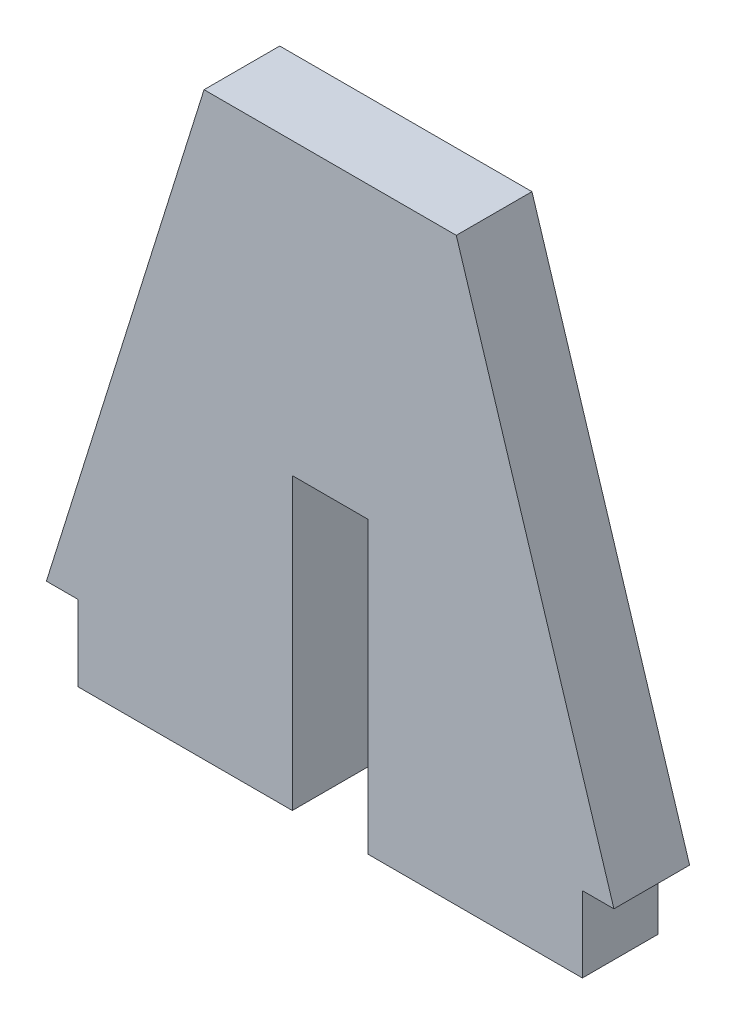
ISO-10303-21;
HEADER;
FILE_DESCRIPTION(('STEP AP214'),'2;1');
FILE_NAME('part.step','',(''),(''),'','','');
FILE_SCHEMA(('AUTOMOTIVE_DESIGN { 1 0 10303 214 1 1 1 1 }'));
ENDSEC;
DATA;
#1=APPLICATION_CONTEXT('core data for automotive mechanical design processes');
#2=APPLICATION_PROTOCOL_DEFINITION('international standard','automotive_design',2000,#1);
#3=PRODUCT_CONTEXT('',#1,'mechanical');
#4=PRODUCT('Part','Part','',(#3));
#5=PRODUCT_RELATED_PRODUCT_CATEGORY('part','',(#4));
#6=PRODUCT_DEFINITION_FORMATION('','',#4);
#7=PRODUCT_DEFINITION_CONTEXT('part definition',#1,'design');
#8=PRODUCT_DEFINITION('design','',#6,#7);
#9=PRODUCT_DEFINITION_SHAPE('','',#8);
#10=(LENGTH_UNIT() NAMED_UNIT(*) SI_UNIT(.MILLI.,.METRE.));
#11=(NAMED_UNIT(*) PLANE_ANGLE_UNIT() SI_UNIT($,.RADIAN.));
#12=(NAMED_UNIT(*) SI_UNIT($,.STERADIAN.) SOLID_ANGLE_UNIT());
#13=UNCERTAINTY_MEASURE_WITH_UNIT(LENGTH_MEASURE(1.E-05),#10,'distance_accuracy_value','');
#14=(GEOMETRIC_REPRESENTATION_CONTEXT(3) GLOBAL_UNCERTAINTY_ASSIGNED_CONTEXT((#13)) GLOBAL_UNIT_ASSIGNED_CONTEXT((#10,
#11,#12)) REPRESENTATION_CONTEXT('',''));
#15=CARTESIAN_POINT('',(0.,0.,0.));
#16=DIRECTION('',(0.,0.,1.));
#17=DIRECTION('',(1.,0.,0.));
#18=AXIS2_PLACEMENT_3D('',#15,#16,#17);
#19=CARTESIAN_POINT('',(-20.,0.,3.));
#20=DIRECTION('',(0.,1.,0.));
#21=DIRECTION('',(-1.,0.,0.));
#22=AXIS2_PLACEMENT_3D('',#19,#20,#21);
#23=PLANE('',#22);
#24=DIRECTION('',(1.,0.,0.));
#25=VECTOR('',#24,1.);
#26=CARTESIAN_POINT('',(-20.,0.,-3.));
#27=LINE('',#26,#25);
#28=CARTESIAN_POINT('',(-20.,0.,-3.));
#29=VERTEX_POINT('',#28);
#30=CARTESIAN_POINT('',(-3.00000000000001,0.,-3.));
#31=VERTEX_POINT('',#30);
#32=EDGE_CURVE('E160',#29,#31,#27,.T.);
#33=ORIENTED_EDGE('',*,*,#32,.T.);
#34=DIRECTION('',(0.,0.,1.));
#35=VECTOR('',#34,1.);
#36=CARTESIAN_POINT('',(-3.00000000000001,0.,-3.));
#37=LINE('',#36,#35);
#38=CARTESIAN_POINT('',(-3.00000000000001,0.,3.));
#39=VERTEX_POINT('',#38);
#40=EDGE_CURVE('E196',#31,#39,#37,.T.);
#41=ORIENTED_EDGE('',*,*,#40,.T.);
#42=DIRECTION('',(1.,0.,0.));
#43=VECTOR('',#42,1.);
#44=CARTESIAN_POINT('',(-20.,0.,3.));
#45=LINE('',#44,#43);
#46=CARTESIAN_POINT('',(-20.,0.,3.));
#47=VERTEX_POINT('',#46);
#48=EDGE_CURVE('E140',#47,#39,#45,.T.);
#49=ORIENTED_EDGE('',*,*,#48,.F.);
#50=DIRECTION('',(0.,0.,-1.));
#51=VECTOR('',#50,1.);
#52=CARTESIAN_POINT('',(-20.,0.,3.));
#53=LINE('',#52,#51);
#54=EDGE_CURVE('E134',#47,#29,#53,.T.);
#55=ORIENTED_EDGE('',*,*,#54,.T.);
#56=EDGE_LOOP('',(#33,#41,#49,#55));
#57=FACE_BOUND('',#56,.T.);
#58=ADVANCED_FACE('F30',(#57),#23,.F.);
#59=CARTESIAN_POINT('',(20.,0.,3.));
#60=DIRECTION('',(-1.,0.,0.));
#61=DIRECTION('',(0.,0.,1.));
#62=AXIS2_PLACEMENT_3D('',#59,#60,#61);
#63=PLANE('',#62);
#64=DIRECTION('',(0.,1.,0.));
#65=VECTOR('',#64,1.);
#66=CARTESIAN_POINT('',(20.,0.,-3.));
#67=LINE('',#66,#65);
#68=CARTESIAN_POINT('',(20.,0.,-3.));
#69=VERTEX_POINT('',#68);
#70=CARTESIAN_POINT('',(20.,6.00000000000001,-3.));
#71=VERTEX_POINT('',#70);
#72=EDGE_CURVE('E145',#69,#71,#67,.T.);
#73=ORIENTED_EDGE('',*,*,#72,.T.);
#74=DIRECTION('',(0.,0.,-1.));
#75=VECTOR('',#74,1.);
#76=CARTESIAN_POINT('',(20.,6.00000000000001,3.));
#77=LINE('',#76,#75);
#78=CARTESIAN_POINT('',(20.,6.00000000000001,3.));
#79=VERTEX_POINT('',#78);
#80=EDGE_CURVE('E11',#79,#71,#77,.T.);
#81=ORIENTED_EDGE('',*,*,#80,.F.);
#82=DIRECTION('',(0.,1.,0.));
#83=VECTOR('',#82,1.);
#84=CARTESIAN_POINT('',(20.,0.,3.));
#85=LINE('',#84,#83);
#86=CARTESIAN_POINT('',(20.,0.,3.));
#87=VERTEX_POINT('',#86);
#88=EDGE_CURVE('E163',#87,#79,#85,.T.);
#89=ORIENTED_EDGE('',*,*,#88,.F.);
#90=DIRECTION('',(0.,0.,-1.));
#91=VECTOR('',#90,1.);
#92=CARTESIAN_POINT('',(20.,0.,3.));
#93=LINE('',#92,#91);
#94=EDGE_CURVE('E144',#87,#69,#93,.T.);
#95=ORIENTED_EDGE('',*,*,#94,.T.);
#96=EDGE_LOOP('',(#73,#81,#89,#95));
#97=FACE_BOUND('',#96,.T.);
#98=ADVANCED_FACE('F32',(#97),#63,.F.);
#99=CARTESIAN_POINT('',(22.5,6.,3.));
#100=DIRECTION('',(0.,1.,0.));
#101=DIRECTION('',(-1.,0.,0.));
#102=AXIS2_PLACEMENT_3D('',#99,#100,#101);
#103=PLANE('',#102);
#104=DIRECTION('',(1.,0.,0.));
#105=VECTOR('',#104,1.);
#106=CARTESIAN_POINT('',(22.5,6.,-3.));
#107=LINE('',#106,#105);
#108=CARTESIAN_POINT('',(22.5,6.,-3.));
#109=VERTEX_POINT('',#108);
#110=EDGE_CURVE('E148',#71,#109,#107,.T.);
#111=ORIENTED_EDGE('',*,*,#110,.T.);
#112=DIRECTION('',(0.,0.,-1.));
#113=VECTOR('',#112,1.);
#114=CARTESIAN_POINT('',(22.5,6.,3.));
#115=LINE('',#114,#113);
#116=CARTESIAN_POINT('',(22.5,6.,3.));
#117=VERTEX_POINT('',#116);
#118=EDGE_CURVE('E38',#117,#109,#115,.T.);
#119=ORIENTED_EDGE('',*,*,#118,.F.);
#120=DIRECTION('',(1.,0.,0.));
#121=VECTOR('',#120,1.);
#122=CARTESIAN_POINT('',(22.5,6.,3.));
#123=LINE('',#122,#121);
#124=EDGE_CURVE('E96',#79,#117,#123,.T.);
#125=ORIENTED_EDGE('',*,*,#124,.F.);
#126=ORIENTED_EDGE('',*,*,#80,.T.);
#127=EDGE_LOOP('',(#111,#119,#125,#126));
#128=FACE_BOUND('',#127,.T.);
#129=ADVANCED_FACE('F244',(#128),#103,.F.);
#130=CARTESIAN_POINT('',(10.,46.,3.));
#131=DIRECTION('',(-0.95447997803503,-0.298274993135947,0.));
#132=DIRECTION('',(0.298274993135947,-0.95447997803503,0.));
#133=AXIS2_PLACEMENT_3D('',#130,#131,#132);
#134=PLANE('',#133);
#135=DIRECTION('',(-0.298274993135947,0.95447997803503,0.));
#136=VECTOR('',#135,1.);
#137=CARTESIAN_POINT('',(10.,46.,-3.));
#138=LINE('',#137,#136);
#139=CARTESIAN_POINT('',(10.,46.,-3.));
#140=VERTEX_POINT('',#139);
#141=EDGE_CURVE('E151',#109,#140,#138,.T.);
#142=ORIENTED_EDGE('',*,*,#141,.T.);
#143=DIRECTION('',(0.,0.,-1.));
#144=VECTOR('',#143,1.);
#145=CARTESIAN_POINT('',(10.,46.,3.));
#146=LINE('',#145,#144);
#147=CARTESIAN_POINT('',(10.,46.,3.));
#148=VERTEX_POINT('',#147);
#149=EDGE_CURVE('E170',#148,#140,#146,.T.);
#150=ORIENTED_EDGE('',*,*,#149,.F.);
#151=DIRECTION('',(-0.298274993135947,0.95447997803503,0.));
#152=VECTOR('',#151,1.);
#153=CARTESIAN_POINT('',(10.,46.,3.));
#154=LINE('',#153,#152);
#155=EDGE_CURVE('E178',#117,#148,#154,.T.);
#156=ORIENTED_EDGE('',*,*,#155,.F.);
#157=ORIENTED_EDGE('',*,*,#118,.T.);
#158=EDGE_LOOP('',(#142,#150,#156,#157));
#159=FACE_BOUND('',#158,.T.);
#160=ADVANCED_FACE('F176',(#159),#134,.F.);
#161=CARTESIAN_POINT('',(10.,46.,3.));
#162=DIRECTION('',(0.,-1.,0.));
#163=DIRECTION('',(0.,0.,-1.));
#164=AXIS2_PLACEMENT_3D('',#161,#162,#163);
#165=PLANE('',#164);
#166=DIRECTION('',(-1.,0.,0.));
#167=VECTOR('',#166,1.);
#168=CARTESIAN_POINT('',(10.,46.,-3.));
#169=LINE('',#168,#167);
#170=CARTESIAN_POINT('',(-10.,46.,-3.));
#171=VERTEX_POINT('',#170);
#172=EDGE_CURVE('E153',#140,#171,#169,.T.);
#173=ORIENTED_EDGE('',*,*,#172,.T.);
#174=DIRECTION('',(0.,0.,-1.));
#175=VECTOR('',#174,1.);
#176=CARTESIAN_POINT('',(-10.,46.,3.));
#177=LINE('',#176,#175);
#178=CARTESIAN_POINT('',(-10.,46.,3.));
#179=VERTEX_POINT('',#178);
#180=EDGE_CURVE('E167',#179,#171,#177,.T.);
#181=ORIENTED_EDGE('',*,*,#180,.F.);
#182=DIRECTION('',(-1.,0.,0.));
#183=VECTOR('',#182,1.);
#184=CARTESIAN_POINT('',(10.,46.,3.));
#185=LINE('',#184,#183);
#186=EDGE_CURVE('E190',#148,#179,#185,.T.);
#187=ORIENTED_EDGE('',*,*,#186,.F.);
#188=ORIENTED_EDGE('',*,*,#149,.T.);
#189=EDGE_LOOP('',(#173,#181,#187,#188));
#190=FACE_BOUND('',#189,.T.);
#191=ADVANCED_FACE('F186',(#190),#165,.F.);
#192=CARTESIAN_POINT('',(-22.5,6.,3.));
#193=DIRECTION('',(0.95447997803503,-0.298274993135947,0.));
#194=DIRECTION('',(0.298274993135947,0.95447997803503,0.));
#195=AXIS2_PLACEMENT_3D('',#192,#193,#194);
#196=PLANE('',#195);
#197=DIRECTION('',(-0.298274993135947,-0.95447997803503,0.));
#198=VECTOR('',#197,1.);
#199=CARTESIAN_POINT('',(-22.5,6.,-3.));
#200=LINE('',#199,#198);
#201=CARTESIAN_POINT('',(-22.5,6.,-3.));
#202=VERTEX_POINT('',#201);
#203=EDGE_CURVE('E155',#171,#202,#200,.T.);
#204=ORIENTED_EDGE('',*,*,#203,.T.);
#205=DIRECTION('',(0.,0.,-1.));
#206=VECTOR('',#205,1.);
#207=CARTESIAN_POINT('',(-22.5,6.,3.));
#208=LINE('',#207,#206);
#209=CARTESIAN_POINT('',(-22.5,6.,3.));
#210=VERTEX_POINT('',#209);
#211=EDGE_CURVE('E133',#210,#202,#208,.T.);
#212=ORIENTED_EDGE('',*,*,#211,.F.);
#213=DIRECTION('',(-0.298274993135947,-0.95447997803503,0.));
#214=VECTOR('',#213,1.);
#215=CARTESIAN_POINT('',(-22.5,6.,3.));
#216=LINE('',#215,#214);
#217=EDGE_CURVE('E121',#179,#210,#216,.T.);
#218=ORIENTED_EDGE('',*,*,#217,.F.);
#219=ORIENTED_EDGE('',*,*,#180,.T.);
#220=EDGE_LOOP('',(#204,#212,#218,#219));
#221=FACE_BOUND('',#220,.T.);
#222=ADVANCED_FACE('F189',(#221),#196,.F.);
#223=CARTESIAN_POINT('',(-20.,6.,3.));
#224=DIRECTION('',(0.,1.,0.));
#225=DIRECTION('',(0.,0.,1.));
#226=AXIS2_PLACEMENT_3D('',#223,#224,#225);
#227=PLANE('',#226);
#228=DIRECTION('',(1.,0.,0.));
#229=VECTOR('',#228,1.);
#230=CARTESIAN_POINT('',(-20.,6.,-3.));
#231=LINE('',#230,#229);
#232=CARTESIAN_POINT('',(-20.,6.,-3.));
#233=VERTEX_POINT('',#232);
#234=EDGE_CURVE('E130',#202,#233,#231,.T.);
#235=ORIENTED_EDGE('',*,*,#234,.T.);
#236=DIRECTION('',(0.,0.,-1.));
#237=VECTOR('',#236,1.);
#238=CARTESIAN_POINT('',(-20.,6.,3.));
#239=LINE('',#238,#237);
#240=CARTESIAN_POINT('',(-20.,6.,3.));
#241=VERTEX_POINT('',#240);
#242=EDGE_CURVE('E127',#241,#233,#239,.T.);
#243=ORIENTED_EDGE('',*,*,#242,.F.);
#244=DIRECTION('',(1.,0.,0.));
#245=VECTOR('',#244,1.);
#246=CARTESIAN_POINT('',(-20.,6.,3.));
#247=LINE('',#246,#245);
#248=EDGE_CURVE('E112',#210,#241,#247,.T.);
#249=ORIENTED_EDGE('',*,*,#248,.F.);
#250=ORIENTED_EDGE('',*,*,#211,.T.);
#251=EDGE_LOOP('',(#235,#243,#249,#250));
#252=FACE_BOUND('',#251,.T.);
#253=ADVANCED_FACE('F128',(#252),#227,.F.);
#254=CARTESIAN_POINT('',(-20.,6.,3.));
#255=DIRECTION('',(1.,0.,0.));
#256=DIRECTION('',(0.,1.,0.));
#257=AXIS2_PLACEMENT_3D('',#254,#255,#256);
#258=PLANE('',#257);
#259=DIRECTION('',(0.,-1.,0.));
#260=VECTOR('',#259,1.);
#261=CARTESIAN_POINT('',(-20.,6.,-3.));
#262=LINE('',#261,#260);
#263=EDGE_CURVE('E158',#233,#29,#262,.T.);
#264=ORIENTED_EDGE('',*,*,#263,.T.);
#265=ORIENTED_EDGE('',*,*,#54,.F.);
#266=DIRECTION('',(0.,-1.,0.));
#267=VECTOR('',#266,1.);
#268=CARTESIAN_POINT('',(-20.,6.,3.));
#269=LINE('',#268,#267);
#270=EDGE_CURVE('E118',#241,#47,#269,.T.);
#271=ORIENTED_EDGE('',*,*,#270,.F.);
#272=ORIENTED_EDGE('',*,*,#242,.T.);
#273=EDGE_LOOP('',(#264,#265,#271,#272));
#274=FACE_BOUND('',#273,.T.);
#275=ADVANCED_FACE('F136',(#274),#258,.F.);
#276=CARTESIAN_POINT('',(3.,0.,3.));
#277=VERTEX_POINT('',#276);
#278=EDGE_CURVE('E54',#277,#87,#45,.T.);
#279=ORIENTED_EDGE('',*,*,#278,.F.);
#280=DIRECTION('',(0.,0.,1.));
#281=VECTOR('',#280,1.);
#282=CARTESIAN_POINT('',(3.,0.,-3.));
#283=LINE('',#282,#281);
#284=CARTESIAN_POINT('',(3.,0.,-3.));
#285=VERTEX_POINT('',#284);
#286=EDGE_CURVE('E199',#285,#277,#283,.T.);
#287=ORIENTED_EDGE('',*,*,#286,.F.);
#288=EDGE_CURVE('E88',#285,#69,#27,.T.);
#289=ORIENTED_EDGE('',*,*,#288,.T.);
#290=ORIENTED_EDGE('',*,*,#94,.F.);
#291=EDGE_LOOP('',(#279,#287,#289,#290));
#292=FACE_BOUND('',#291,.T.);
#293=ADVANCED_FACE('F240',(#292),#23,.F.);
#294=CARTESIAN_POINT('',(20.,6.00000000000001,3.));
#295=DIRECTION('',(0.,0.,1.));
#296=DIRECTION('',(1.,0.,0.));
#297=AXIS2_PLACEMENT_3D('',#294,#295,#296);
#298=PLANE('',#297);
#299=DIRECTION('',(0.,-1.,0.));
#300=VECTOR('',#299,1.);
#301=CARTESIAN_POINT('',(-3.00000000000001,0.,3.));
#302=LINE('',#301,#300);
#303=CARTESIAN_POINT('',(-3.,23.,3.));
#304=VERTEX_POINT('',#303);
#305=EDGE_CURVE('E213',#304,#39,#302,.T.);
#306=ORIENTED_EDGE('',*,*,#305,.F.);
#307=DIRECTION('',(-1.,0.,0.));
#308=VECTOR('',#307,1.);
#309=CARTESIAN_POINT('',(-3.,23.,3.));
#310=LINE('',#309,#308);
#311=CARTESIAN_POINT('',(3.,23.,3.));
#312=VERTEX_POINT('',#311);
#313=EDGE_CURVE('E206',#312,#304,#310,.T.);
#314=ORIENTED_EDGE('',*,*,#313,.F.);
#315=DIRECTION('',(0.,1.,0.));
#316=VECTOR('',#315,1.);
#317=CARTESIAN_POINT('',(3.,0.,3.));
#318=LINE('',#317,#316);
#319=EDGE_CURVE('E210',#277,#312,#318,.T.);
#320=ORIENTED_EDGE('',*,*,#319,.F.);
#321=ORIENTED_EDGE('',*,*,#278,.T.);
#322=ORIENTED_EDGE('',*,*,#88,.T.);
#323=ORIENTED_EDGE('',*,*,#124,.T.);
#324=ORIENTED_EDGE('',*,*,#155,.T.);
#325=ORIENTED_EDGE('',*,*,#186,.T.);
#326=ORIENTED_EDGE('',*,*,#217,.T.);
#327=ORIENTED_EDGE('',*,*,#248,.T.);
#328=ORIENTED_EDGE('',*,*,#270,.T.);
#329=ORIENTED_EDGE('',*,*,#48,.T.);
#330=EDGE_LOOP('',(#306,#314,#320,#321,#322,#323,#324,#325,#326,#327,#328,#329));
#331=FACE_BOUND('',#330,.T.);
#332=ADVANCED_FACE('F115',(#331),#298,.T.);
#333=CARTESIAN_POINT('',(20.,6.00000000000001,-3.));
#334=DIRECTION('',(0.,0.,1.));
#335=DIRECTION('',(1.,0.,0.));
#336=AXIS2_PLACEMENT_3D('',#333,#334,#335);
#337=PLANE('',#336);
#338=DIRECTION('',(-1.,0.,0.));
#339=VECTOR('',#338,1.);
#340=CARTESIAN_POINT('',(-3.,23.,-3.));
#341=LINE('',#340,#339);
#342=CARTESIAN_POINT('',(3.,23.,-3.));
#343=VERTEX_POINT('',#342);
#344=CARTESIAN_POINT('',(-3.,23.,-3.));
#345=VERTEX_POINT('',#344);
#346=EDGE_CURVE('E45',#343,#345,#341,.T.);
#347=ORIENTED_EDGE('',*,*,#346,.T.);
#348=DIRECTION('',(0.,-1.,0.));
#349=VECTOR('',#348,1.);
#350=CARTESIAN_POINT('',(-3.00000000000001,0.,-3.));
#351=LINE('',#350,#349);
#352=EDGE_CURVE('E209',#345,#31,#351,.T.);
#353=ORIENTED_EDGE('',*,*,#352,.T.);
#354=ORIENTED_EDGE('',*,*,#32,.F.);
#355=ORIENTED_EDGE('',*,*,#263,.F.);
#356=ORIENTED_EDGE('',*,*,#234,.F.);
#357=ORIENTED_EDGE('',*,*,#203,.F.);
#358=ORIENTED_EDGE('',*,*,#172,.F.);
#359=ORIENTED_EDGE('',*,*,#141,.F.);
#360=ORIENTED_EDGE('',*,*,#110,.F.);
#361=ORIENTED_EDGE('',*,*,#72,.F.);
#362=ORIENTED_EDGE('',*,*,#288,.F.);
#363=DIRECTION('',(0.,1.,0.));
#364=VECTOR('',#363,1.);
#365=CARTESIAN_POINT('',(3.,0.,-3.));
#366=LINE('',#365,#364);
#367=EDGE_CURVE('E217',#285,#343,#366,.T.);
#368=ORIENTED_EDGE('',*,*,#367,.T.);
#369=EDGE_LOOP('',(#347,#353,#354,#355,#356,#357,#358,#359,#360,#361,#362,#368));
#370=FACE_BOUND('',#369,.T.);
#371=ADVANCED_FACE('F181',(#370),#337,.F.);
#372=CARTESIAN_POINT('',(-3.00000000000001,0.,-3.));
#373=DIRECTION('',(-1.,0.,0.));
#374=DIRECTION('',(0.,-1.,0.));
#375=AXIS2_PLACEMENT_3D('',#372,#373,#374);
#376=PLANE('',#375);
#377=ORIENTED_EDGE('',*,*,#305,.T.);
#378=ORIENTED_EDGE('',*,*,#40,.F.);
#379=ORIENTED_EDGE('',*,*,#352,.F.);
#380=DIRECTION('',(0.,0.,1.));
#381=VECTOR('',#380,1.);
#382=CARTESIAN_POINT('',(-3.,23.,-3.));
#383=LINE('',#382,#381);
#384=EDGE_CURVE('E149',#345,#304,#383,.T.);
#385=ORIENTED_EDGE('',*,*,#384,.T.);
#386=EDGE_LOOP('',(#377,#378,#379,#385));
#387=FACE_BOUND('',#386,.T.);
#388=ADVANCED_FACE('F237',(#387),#376,.F.);
#389=CARTESIAN_POINT('',(-3.,23.,-3.));
#390=DIRECTION('',(0.,1.,0.));
#391=DIRECTION('',(0.,0.,1.));
#392=AXIS2_PLACEMENT_3D('',#389,#390,#391);
#393=PLANE('',#392);
#394=ORIENTED_EDGE('',*,*,#313,.T.);
#395=ORIENTED_EDGE('',*,*,#384,.F.);
#396=ORIENTED_EDGE('',*,*,#346,.F.);
#397=DIRECTION('',(0.,0.,1.));
#398=VECTOR('',#397,1.);
#399=CARTESIAN_POINT('',(3.,23.,-3.));
#400=LINE('',#399,#398);
#401=EDGE_CURVE('E202',#343,#312,#400,.T.);
#402=ORIENTED_EDGE('',*,*,#401,.T.);
#403=EDGE_LOOP('',(#394,#395,#396,#402));
#404=FACE_BOUND('',#403,.T.);
#405=ADVANCED_FACE('F238',(#404),#393,.F.);
#406=CARTESIAN_POINT('',(3.,0.,-3.));
#407=DIRECTION('',(1.,0.,0.));
#408=DIRECTION('',(0.,1.,0.));
#409=AXIS2_PLACEMENT_3D('',#406,#407,#408);
#410=PLANE('',#409);
#411=ORIENTED_EDGE('',*,*,#319,.T.);
#412=ORIENTED_EDGE('',*,*,#401,.F.);
#413=ORIENTED_EDGE('',*,*,#367,.F.);
#414=ORIENTED_EDGE('',*,*,#286,.T.);
#415=EDGE_LOOP('',(#411,#412,#413,#414));
#416=FACE_BOUND('',#415,.T.);
#417=ADVANCED_FACE('F325',(#416),#410,.F.);
#418=CLOSED_SHELL('',(#58,#98,#129,#160,#191,#222,#253,#275,#293,#332,#371,#388,#405,#417));
#419=MANIFOLD_SOLID_BREP('B2',#418);
#420=ADVANCED_BREP_SHAPE_REPRESENTATION('',(#18,#419),#14);
#421=SHAPE_DEFINITION_REPRESENTATION(#9,#420);
ENDSEC;
END-ISO-10303-21;
